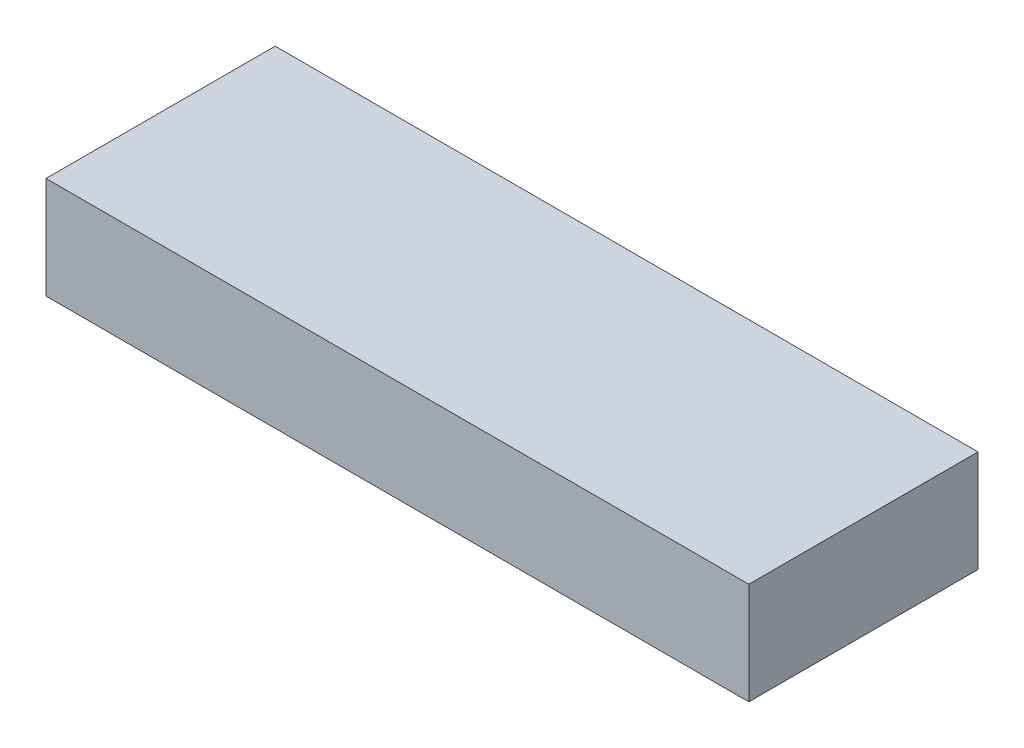
ISO-10303-21;
HEADER;
FILE_DESCRIPTION(('STEP AP214'),'2;1');
FILE_NAME('part.step','',(''),(''),'','','');
FILE_SCHEMA(('AUTOMOTIVE_DESIGN { 1 0 10303 214 1 1 1 1 }'));
ENDSEC;
DATA;
#1=APPLICATION_CONTEXT('core data for automotive mechanical design processes');
#2=APPLICATION_PROTOCOL_DEFINITION('international standard','automotive_design',2000,#1);
#3=PRODUCT_CONTEXT('',#1,'mechanical');
#4=PRODUCT('Part','Part','',(#3));
#5=PRODUCT_RELATED_PRODUCT_CATEGORY('part','',(#4));
#6=PRODUCT_DEFINITION_FORMATION('','',#4);
#7=PRODUCT_DEFINITION_CONTEXT('part definition',#1,'design');
#8=PRODUCT_DEFINITION('design','',#6,#7);
#9=PRODUCT_DEFINITION_SHAPE('','',#8);
#10=(LENGTH_UNIT() NAMED_UNIT(*) SI_UNIT(.MILLI.,.METRE.));
#11=(NAMED_UNIT(*) PLANE_ANGLE_UNIT() SI_UNIT($,.RADIAN.));
#12=(NAMED_UNIT(*) SI_UNIT($,.STERADIAN.) SOLID_ANGLE_UNIT());
#13=UNCERTAINTY_MEASURE_WITH_UNIT(LENGTH_MEASURE(1.E-05),#10,'distance_accuracy_value','');
#14=(GEOMETRIC_REPRESENTATION_CONTEXT(3) GLOBAL_UNCERTAINTY_ASSIGNED_CONTEXT((#13)) GLOBAL_UNIT_ASSIGNED_CONTEXT((#10,
#11,#12)) REPRESENTATION_CONTEXT('',''));
#15=CARTESIAN_POINT('',(0.,0.,0.));
#16=DIRECTION('',(0.,0.,1.));
#17=DIRECTION('',(1.,0.,0.));
#18=AXIS2_PLACEMENT_3D('',#15,#16,#17);
#19=CARTESIAN_POINT('',(0.,20.,-45.));
#20=DIRECTION('',(1.,0.,0.));
#21=DIRECTION('',(0.,0.,-1.));
#22=AXIS2_PLACEMENT_3D('',#19,#20,#21);
#23=PLANE('',#22);
#24=DIRECTION('',(0.,0.,1.));
#25=VECTOR('',#24,1.);
#26=CARTESIAN_POINT('',(0.,0.,-45.));
#27=LINE('',#26,#25);
#28=CARTESIAN_POINT('',(0.,0.,-45.));
#29=VERTEX_POINT('',#28);
#30=CARTESIAN_POINT('',(0.,0.,0.));
#31=VERTEX_POINT('',#30);
#32=EDGE_CURVE('E95',#29,#31,#27,.T.);
#33=ORIENTED_EDGE('',*,*,#32,.T.);
#34=DIRECTION('',(0.,-1.,0.));
#35=VECTOR('',#34,1.);
#36=CARTESIAN_POINT('',(0.,20.,0.));
#37=LINE('',#36,#35);
#38=CARTESIAN_POINT('',(0.,20.,0.));
#39=VERTEX_POINT('',#38);
#40=EDGE_CURVE('E11',#39,#31,#37,.T.);
#41=ORIENTED_EDGE('',*,*,#40,.F.);
#42=DIRECTION('',(0.,0.,1.));
#43=VECTOR('',#42,1.);
#44=CARTESIAN_POINT('',(0.,20.,-45.));
#45=LINE('',#44,#43);
#46=CARTESIAN_POINT('',(0.,20.,-45.));
#47=VERTEX_POINT('',#46);
#48=EDGE_CURVE('E83',#47,#39,#45,.T.);
#49=ORIENTED_EDGE('',*,*,#48,.F.);
#50=DIRECTION('',(0.,-1.,0.));
#51=VECTOR('',#50,1.);
#52=CARTESIAN_POINT('',(0.,20.,-45.));
#53=LINE('',#52,#51);
#54=EDGE_CURVE('E91',#47,#29,#53,.T.);
#55=ORIENTED_EDGE('',*,*,#54,.T.);
#56=EDGE_LOOP('',(#33,#41,#49,#55));
#57=FACE_BOUND('',#56,.T.);
#58=ADVANCED_FACE('F32',(#57),#23,.F.);
#59=CARTESIAN_POINT('',(0.,20.,0.));
#60=DIRECTION('',(0.,0.,-1.));
#61=DIRECTION('',(-1.,0.,0.));
#62=AXIS2_PLACEMENT_3D('',#59,#60,#61);
#63=PLANE('',#62);
#64=DIRECTION('',(1.,0.,0.));
#65=VECTOR('',#64,1.);
#66=CARTESIAN_POINT('',(0.,0.,0.));
#67=LINE('',#66,#65);
#68=CARTESIAN_POINT('',(138.,0.,0.));
#69=VERTEX_POINT('',#68);
#70=EDGE_CURVE('E87',#31,#69,#67,.T.);
#71=ORIENTED_EDGE('',*,*,#70,.T.);
#72=DIRECTION('',(0.,-1.,0.));
#73=VECTOR('',#72,1.);
#74=CARTESIAN_POINT('',(138.,20.,0.));
#75=LINE('',#74,#73);
#76=CARTESIAN_POINT('',(138.,20.,0.));
#77=VERTEX_POINT('',#76);
#78=EDGE_CURVE('E40',#77,#69,#75,.T.);
#79=ORIENTED_EDGE('',*,*,#78,.F.);
#80=DIRECTION('',(1.,0.,0.));
#81=VECTOR('',#80,1.);
#82=CARTESIAN_POINT('',(0.,20.,0.));
#83=LINE('',#82,#81);
#84=EDGE_CURVE('E78',#39,#77,#83,.T.);
#85=ORIENTED_EDGE('',*,*,#84,.F.);
#86=ORIENTED_EDGE('',*,*,#40,.T.);
#87=EDGE_LOOP('',(#71,#79,#85,#86));
#88=FACE_BOUND('',#87,.T.);
#89=ADVANCED_FACE('F86',(#88),#63,.F.);
#90=CARTESIAN_POINT('',(138.,20.,0.));
#91=DIRECTION('',(-1.,0.,0.));
#92=DIRECTION('',(0.,0.,1.));
#93=AXIS2_PLACEMENT_3D('',#90,#91,#92);
#94=PLANE('',#93);
#95=DIRECTION('',(0.,0.,-1.));
#96=VECTOR('',#95,1.);
#97=CARTESIAN_POINT('',(138.,0.,0.));
#98=LINE('',#97,#96);
#99=CARTESIAN_POINT('',(138.,0.,-45.));
#100=VERTEX_POINT('',#99);
#101=EDGE_CURVE('E65',#69,#100,#98,.T.);
#102=ORIENTED_EDGE('',*,*,#101,.T.);
#103=DIRECTION('',(0.,-1.,0.));
#104=VECTOR('',#103,1.);
#105=CARTESIAN_POINT('',(138.,20.,-45.));
#106=LINE('',#105,#104);
#107=CARTESIAN_POINT('',(138.,20.,-45.));
#108=VERTEX_POINT('',#107);
#109=EDGE_CURVE('E88',#108,#100,#106,.T.);
#110=ORIENTED_EDGE('',*,*,#109,.F.);
#111=DIRECTION('',(0.,0.,-1.));
#112=VECTOR('',#111,1.);
#113=CARTESIAN_POINT('',(138.,20.,0.));
#114=LINE('',#113,#112);
#115=EDGE_CURVE('E81',#77,#108,#114,.T.);
#116=ORIENTED_EDGE('',*,*,#115,.F.);
#117=ORIENTED_EDGE('',*,*,#78,.T.);
#118=EDGE_LOOP('',(#102,#110,#116,#117));
#119=FACE_BOUND('',#118,.T.);
#120=ADVANCED_FACE('F89',(#119),#94,.F.);
#121=CARTESIAN_POINT('',(138.,20.,-45.));
#122=DIRECTION('',(0.,0.,1.));
#123=DIRECTION('',(1.,0.,0.));
#124=AXIS2_PLACEMENT_3D('',#121,#122,#123);
#125=PLANE('',#124);
#126=DIRECTION('',(-1.,0.,0.));
#127=VECTOR('',#126,1.);
#128=CARTESIAN_POINT('',(138.,0.,-45.));
#129=LINE('',#128,#127);
#130=EDGE_CURVE('E71',#100,#29,#129,.T.);
#131=ORIENTED_EDGE('',*,*,#130,.T.);
#132=ORIENTED_EDGE('',*,*,#54,.F.);
#133=DIRECTION('',(-1.,0.,0.));
#134=VECTOR('',#133,1.);
#135=CARTESIAN_POINT('',(138.,20.,-45.));
#136=LINE('',#135,#134);
#137=EDGE_CURVE('E48',#108,#47,#136,.T.);
#138=ORIENTED_EDGE('',*,*,#137,.F.);
#139=ORIENTED_EDGE('',*,*,#109,.T.);
#140=EDGE_LOOP('',(#131,#132,#138,#139));
#141=FACE_BOUND('',#140,.T.);
#142=ADVANCED_FACE('F102',(#141),#125,.F.);
#143=CARTESIAN_POINT('',(0.,20.,0.));
#144=DIRECTION('',(0.,1.,0.));
#145=DIRECTION('',(0.,0.,1.));
#146=AXIS2_PLACEMENT_3D('',#143,#144,#145);
#147=PLANE('',#146);
#148=ORIENTED_EDGE('',*,*,#48,.T.);
#149=ORIENTED_EDGE('',*,*,#84,.T.);
#150=ORIENTED_EDGE('',*,*,#115,.T.);
#151=ORIENTED_EDGE('',*,*,#137,.T.);
#152=EDGE_LOOP('',(#148,#149,#150,#151));
#153=FACE_BOUND('',#152,.T.);
#154=ADVANCED_FACE('F79',(#153),#147,.T.);
#155=CARTESIAN_POINT('',(0.,0.,0.));
#156=DIRECTION('',(0.,1.,0.));
#157=DIRECTION('',(0.,0.,1.));
#158=AXIS2_PLACEMENT_3D('',#155,#156,#157);
#159=PLANE('',#158);
#160=ORIENTED_EDGE('',*,*,#32,.F.);
#161=ORIENTED_EDGE('',*,*,#130,.F.);
#162=ORIENTED_EDGE('',*,*,#101,.F.);
#163=ORIENTED_EDGE('',*,*,#70,.F.);
#164=EDGE_LOOP('',(#160,#161,#162,#163));
#165=FACE_BOUND('',#164,.T.);
#166=ADVANCED_FACE('F105',(#165),#159,.F.);
#167=CLOSED_SHELL('',(#58,#89,#120,#142,#154,#166));
#168=MANIFOLD_SOLID_BREP('B2',#167);
#169=ADVANCED_BREP_SHAPE_REPRESENTATION('',(#18,#168),#14);
#170=SHAPE_DEFINITION_REPRESENTATION(#9,#169);
ENDSEC;
END-ISO-10303-21;
